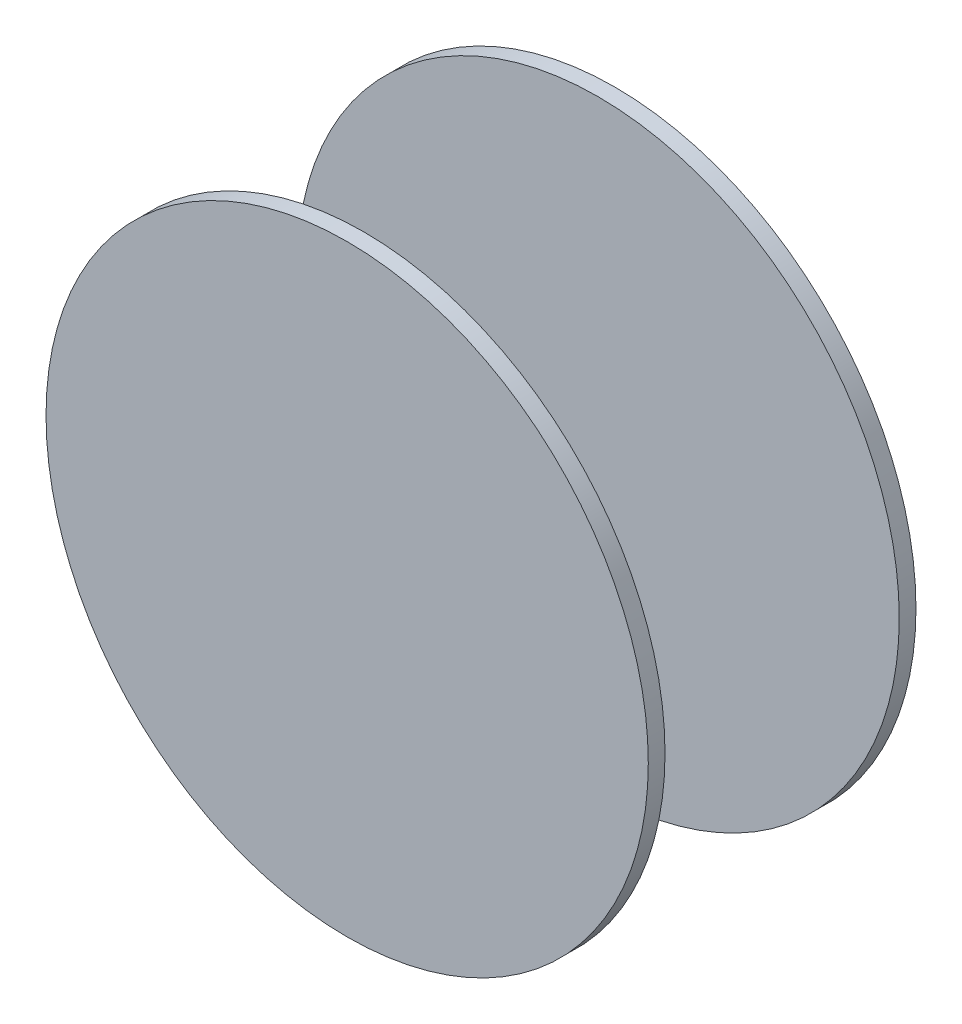
ISO-10303-21;
HEADER;
FILE_DESCRIPTION(('STEP AP214'),'2;1');
FILE_NAME('part.step','',(''),(''),'','','');
FILE_SCHEMA(('AUTOMOTIVE_DESIGN { 1 0 10303 214 1 1 1 1 }'));
ENDSEC;
DATA;
#1=APPLICATION_CONTEXT('core data for automotive mechanical design processes');
#2=APPLICATION_PROTOCOL_DEFINITION('international standard','automotive_design',2000,#1);
#3=PRODUCT_CONTEXT('',#1,'mechanical');
#4=PRODUCT('Part','Part','',(#3));
#5=PRODUCT_RELATED_PRODUCT_CATEGORY('part','',(#4));
#6=PRODUCT_DEFINITION_FORMATION('','',#4);
#7=PRODUCT_DEFINITION_CONTEXT('part definition',#1,'design');
#8=PRODUCT_DEFINITION('design','',#6,#7);
#9=PRODUCT_DEFINITION_SHAPE('','',#8);
#10=(LENGTH_UNIT() NAMED_UNIT(*) SI_UNIT(.MILLI.,.METRE.));
#11=(NAMED_UNIT(*) PLANE_ANGLE_UNIT() SI_UNIT($,.RADIAN.));
#12=(NAMED_UNIT(*) SI_UNIT($,.STERADIAN.) SOLID_ANGLE_UNIT());
#13=UNCERTAINTY_MEASURE_WITH_UNIT(LENGTH_MEASURE(1.E-05),#10,'distance_accuracy_value','');
#14=(GEOMETRIC_REPRESENTATION_CONTEXT(3) GLOBAL_UNCERTAINTY_ASSIGNED_CONTEXT((#13)) GLOBAL_UNIT_ASSIGNED_CONTEXT((#10,
#11,#12)) REPRESENTATION_CONTEXT('',''));
#15=CARTESIAN_POINT('',(0.,0.,0.));
#16=DIRECTION('',(0.,0.,1.));
#17=DIRECTION('',(1.,0.,0.));
#18=AXIS2_PLACEMENT_3D('',#15,#16,#17);
#19=CARTESIAN_POINT('',(0.,0.,20.));
#20=DIRECTION('',(0.,0.,-1.));
#21=DIRECTION('',(-1.,0.,0.));
#22=AXIS2_PLACEMENT_3D('',#19,#20,#21);
#23=CYLINDRICAL_SURFACE('',#22,45.);
#24=CARTESIAN_POINT('',(0.,0.,-20.));
#25=DIRECTION('',(0.,0.,1.));
#26=DIRECTION('',(1.,0.,0.));
#27=AXIS2_PLACEMENT_3D('',#24,#25,#26);
#28=CIRCLE('',#27,45.);
#29=CARTESIAN_POINT('',(45.,0.,-20.));
#30=VERTEX_POINT('',#29);
#31=EDGE_CURVE('E47',#30,#30,#28,.T.);
#32=ORIENTED_EDGE('',*,*,#31,.T.);
#33=EDGE_LOOP('',(#32));
#34=FACE_BOUND('',#33,.T.);
#35=CARTESIAN_POINT('',(0.,0.,-17.5));
#36=DIRECTION('',(0.,0.,1.));
#37=DIRECTION('',(1.,0.,0.));
#38=AXIS2_PLACEMENT_3D('',#35,#36,#37);
#39=CIRCLE('',#38,45.);
#40=CARTESIAN_POINT('',(45.,0.,-17.5));
#41=VERTEX_POINT('',#40);
#42=EDGE_CURVE('E11',#41,#41,#39,.T.);
#43=ORIENTED_EDGE('',*,*,#42,.F.);
#44=EDGE_LOOP('',(#43));
#45=FACE_BOUND('',#44,.T.);
#46=ADVANCED_FACE('F41',(#34,#45),#23,.T.);
#47=CARTESIAN_POINT('',(0.,0.,-20.));
#48=DIRECTION('',(0.,0.,1.));
#49=DIRECTION('',(1.,0.,0.));
#50=AXIS2_PLACEMENT_3D('',#47,#48,#49);
#51=PLANE('',#50);
#52=ORIENTED_EDGE('',*,*,#31,.F.);
#53=EDGE_LOOP('',(#52));
#54=FACE_BOUND('',#53,.T.);
#55=ADVANCED_FACE('F55',(#54),#51,.F.);
#56=CARTESIAN_POINT('',(0.,0.,-17.5));
#57=DIRECTION('',(0.,0.,1.));
#58=DIRECTION('',(1.,0.,0.));
#59=AXIS2_PLACEMENT_3D('',#56,#57,#58);
#60=PLANE('',#59);
#61=ORIENTED_EDGE('',*,*,#42,.T.);
#62=EDGE_LOOP('',(#61));
#63=FACE_BOUND('',#62,.T.);
#64=ADVANCED_FACE('F57',(#63),#60,.T.);
#65=CLOSED_SHELL('',(#46,#55,#64));
#66=MANIFOLD_SOLID_BREP('B2',#65);
#67=CARTESIAN_POINT('',(0.,0.,20.));
#68=DIRECTION('',(0.,0.,1.));
#69=DIRECTION('',(1.,0.,0.));
#70=AXIS2_PLACEMENT_3D('',#67,#68,#69);
#71=PLANE('',#70);
#72=CARTESIAN_POINT('',(0.,0.,20.));
#73=DIRECTION('',(0.,0.,1.));
#74=DIRECTION('',(1.,0.,0.));
#75=AXIS2_PLACEMENT_3D('',#72,#73,#74);
#76=CIRCLE('',#75,45.);
#77=CARTESIAN_POINT('',(45.,0.,20.));
#78=VERTEX_POINT('',#77);
#79=EDGE_CURVE('E40',#78,#78,#76,.T.);
#80=ORIENTED_EDGE('',*,*,#79,.T.);
#81=EDGE_LOOP('',(#80));
#82=FACE_BOUND('',#81,.T.);
#83=ADVANCED_FACE('F85',(#82),#71,.T.);
#84=CARTESIAN_POINT('',(0.,0.,20.));
#85=DIRECTION('',(0.,0.,-1.));
#86=DIRECTION('',(-1.,0.,0.));
#87=AXIS2_PLACEMENT_3D('',#84,#85,#86);
#88=CYLINDRICAL_SURFACE('',#87,45.);
#89=CARTESIAN_POINT('',(0.,0.,17.5));
#90=DIRECTION('',(0.,0.,1.));
#91=DIRECTION('',(1.,0.,0.));
#92=AXIS2_PLACEMENT_3D('',#89,#90,#91);
#93=CIRCLE('',#92,45.);
#94=CARTESIAN_POINT('',(45.,0.,17.5));
#95=VERTEX_POINT('',#94);
#96=EDGE_CURVE('E92',#95,#95,#93,.T.);
#97=ORIENTED_EDGE('',*,*,#96,.T.);
#98=EDGE_LOOP('',(#97));
#99=FACE_BOUND('',#98,.T.);
#100=ORIENTED_EDGE('',*,*,#79,.F.);
#101=EDGE_LOOP('',(#100));
#102=FACE_BOUND('',#101,.T.);
#103=ADVANCED_FACE('F87',(#99,#102),#88,.T.);
#104=CARTESIAN_POINT('',(0.,0.,17.5));
#105=DIRECTION('',(0.,0.,1.));
#106=DIRECTION('',(1.,0.,0.));
#107=AXIS2_PLACEMENT_3D('',#104,#105,#106);
#108=PLANE('',#107);
#109=ORIENTED_EDGE('',*,*,#96,.F.);
#110=EDGE_LOOP('',(#109));
#111=FACE_BOUND('',#110,.T.);
#112=ADVANCED_FACE('F100',(#111),#108,.F.);
#113=CLOSED_SHELL('',(#83,#103,#112));
#114=MANIFOLD_SOLID_BREP('B6',#113);
#115=ADVANCED_BREP_SHAPE_REPRESENTATION('',(#18,#66,#114),#14);
#116=SHAPE_DEFINITION_REPRESENTATION(#9,#115);
ENDSEC;
END-ISO-10303-21;
